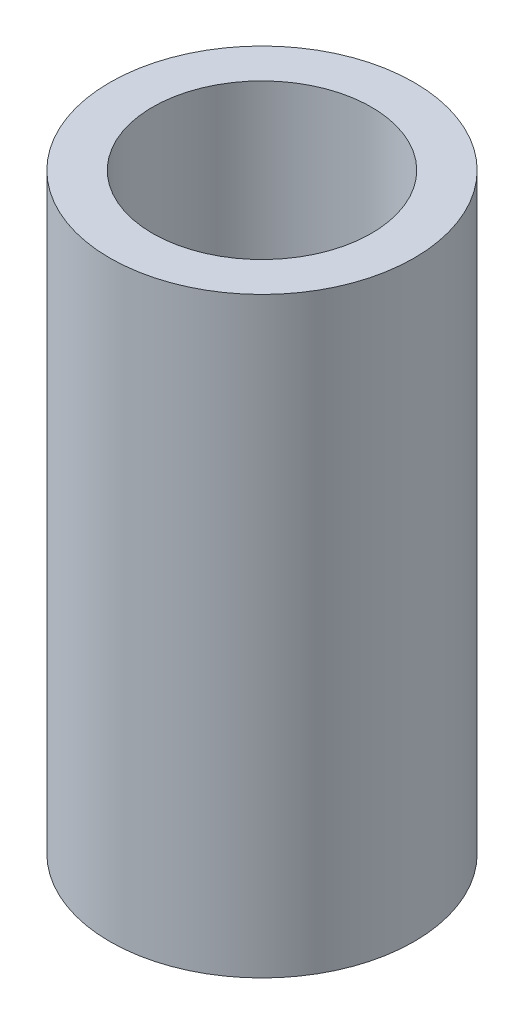
ISO-10303-21;
HEADER;
FILE_DESCRIPTION(('STEP AP214'),'2;1');
FILE_NAME('part.step','',(''),(''),'','','');
FILE_SCHEMA(('AUTOMOTIVE_DESIGN { 1 0 10303 214 1 1 1 1 }'));
ENDSEC;
DATA;
#1=APPLICATION_CONTEXT('core data for automotive mechanical design processes');
#2=APPLICATION_PROTOCOL_DEFINITION('international standard','automotive_design',2000,#1);
#3=PRODUCT_CONTEXT('',#1,'mechanical');
#4=PRODUCT('Part','Part','',(#3));
#5=PRODUCT_RELATED_PRODUCT_CATEGORY('part','',(#4));
#6=PRODUCT_DEFINITION_FORMATION('','',#4);
#7=PRODUCT_DEFINITION_CONTEXT('part definition',#1,'design');
#8=PRODUCT_DEFINITION('design','',#6,#7);
#9=PRODUCT_DEFINITION_SHAPE('','',#8);
#10=(LENGTH_UNIT() NAMED_UNIT(*) SI_UNIT(.MILLI.,.METRE.));
#11=(NAMED_UNIT(*) PLANE_ANGLE_UNIT() SI_UNIT($,.RADIAN.));
#12=(NAMED_UNIT(*) SI_UNIT($,.STERADIAN.) SOLID_ANGLE_UNIT());
#13=UNCERTAINTY_MEASURE_WITH_UNIT(LENGTH_MEASURE(1.E-05),#10,'distance_accuracy_value','');
#14=(GEOMETRIC_REPRESENTATION_CONTEXT(3) GLOBAL_UNCERTAINTY_ASSIGNED_CONTEXT((#13)) GLOBAL_UNIT_ASSIGNED_CONTEXT((#10,
#11,#12)) REPRESENTATION_CONTEXT('',''));
#15=CARTESIAN_POINT('',(0.,0.,0.));
#16=DIRECTION('',(0.,0.,1.));
#17=DIRECTION('',(1.,0.,0.));
#18=AXIS2_PLACEMENT_3D('',#15,#16,#17);
#19=CARTESIAN_POINT('',(0.,87.5405346438115,0.));
#20=DIRECTION('',(0.,-1.,0.));
#21=DIRECTION('',(0.,0.,-1.));
#22=AXIS2_PLACEMENT_3D('',#19,#20,#21);
#23=CYLINDRICAL_SURFACE('',#22,22.5);
#24=CARTESIAN_POINT('',(0.,87.5405346438115,0.));
#25=DIRECTION('',(0.,1.,0.));
#26=DIRECTION('',(0.,0.,1.));
#27=AXIS2_PLACEMENT_3D('',#24,#25,#26);
#28=CIRCLE('',#27,22.5);
#29=CARTESIAN_POINT('',(0.,87.5405346438115,22.5));
#30=VERTEX_POINT('',#29);
#31=EDGE_CURVE('E10',#30,#30,#28,.T.);
#32=ORIENTED_EDGE('',*,*,#31,.F.);
#33=EDGE_LOOP('',(#32));
#34=FACE_BOUND('',#33,.T.);
#35=CARTESIAN_POINT('',(0.,0.,0.));
#36=DIRECTION('',(0.,1.,0.));
#37=DIRECTION('',(0.,0.,1.));
#38=AXIS2_PLACEMENT_3D('',#35,#36,#37);
#39=CIRCLE('',#38,22.5);
#40=CARTESIAN_POINT('',(0.,0.,22.5));
#41=VERTEX_POINT('',#40);
#42=EDGE_CURVE('E37',#41,#41,#39,.T.);
#43=ORIENTED_EDGE('',*,*,#42,.T.);
#44=EDGE_LOOP('',(#43));
#45=FACE_BOUND('',#44,.T.);
#46=ADVANCED_FACE('F40',(#34,#45),#23,.T.);
#47=CARTESIAN_POINT('',(0.,87.5405346438115,0.));
#48=DIRECTION('',(0.,1.,0.));
#49=DIRECTION('',(0.,0.,1.));
#50=AXIS2_PLACEMENT_3D('',#47,#48,#49);
#51=PLANE('',#50);
#52=CARTESIAN_POINT('',(0.,87.5405346438115,0.));
#53=DIRECTION('',(0.,1.,0.));
#54=DIRECTION('',(0.,0.,1.));
#55=AXIS2_PLACEMENT_3D('',#52,#53,#54);
#56=CIRCLE('',#55,16.1838825567381);
#57=CARTESIAN_POINT('',(0.,87.5405346438115,16.1838825567381));
#58=VERTEX_POINT('',#57);
#59=EDGE_CURVE('E50',#58,#58,#56,.T.);
#60=ORIENTED_EDGE('',*,*,#59,.F.);
#61=EDGE_LOOP('',(#60));
#62=FACE_BOUND('',#61,.T.);
#63=ORIENTED_EDGE('',*,*,#31,.T.);
#64=EDGE_LOOP('',(#63));
#65=FACE_BOUND('',#64,.T.);
#66=ADVANCED_FACE('F59',(#62,#65),#51,.T.);
#67=CARTESIAN_POINT('',(0.,0.,0.));
#68=DIRECTION('',(0.,1.,0.));
#69=DIRECTION('',(0.,0.,1.));
#70=AXIS2_PLACEMENT_3D('',#67,#68,#69);
#71=PLANE('',#70);
#72=CARTESIAN_POINT('',(0.,0.,0.));
#73=DIRECTION('',(0.,1.,0.));
#74=DIRECTION('',(0.,0.,1.));
#75=AXIS2_PLACEMENT_3D('',#72,#73,#74);
#76=CIRCLE('',#75,16.1838825567381);
#77=CARTESIAN_POINT('',(0.,0.,16.1838825567381));
#78=VERTEX_POINT('',#77);
#79=EDGE_CURVE('E47',#78,#78,#76,.T.);
#80=ORIENTED_EDGE('',*,*,#79,.T.);
#81=EDGE_LOOP('',(#80));
#82=FACE_BOUND('',#81,.T.);
#83=ORIENTED_EDGE('',*,*,#42,.F.);
#84=EDGE_LOOP('',(#83));
#85=FACE_BOUND('',#84,.T.);
#86=ADVANCED_FACE('F58',(#82,#85),#71,.F.);
#87=CARTESIAN_POINT('',(0.,87.5405346438115,0.));
#88=DIRECTION('',(0.,-1.,0.));
#89=DIRECTION('',(0.,0.,-1.));
#90=AXIS2_PLACEMENT_3D('',#87,#88,#89);
#91=CYLINDRICAL_SURFACE('',#90,16.1838825567381);
#92=ORIENTED_EDGE('',*,*,#59,.T.);
#93=EDGE_LOOP('',(#92));
#94=FACE_BOUND('',#93,.T.);
#95=ORIENTED_EDGE('',*,*,#79,.F.);
#96=EDGE_LOOP('',(#95));
#97=FACE_BOUND('',#96,.T.);
#98=ADVANCED_FACE('F54',(#94,#97),#91,.F.);
#99=CLOSED_SHELL('',(#46,#66,#86,#98));
#100=MANIFOLD_SOLID_BREP('B2',#99);
#101=ADVANCED_BREP_SHAPE_REPRESENTATION('',(#18,#100),#14);
#102=SHAPE_DEFINITION_REPRESENTATION(#9,#101);
ENDSEC;
END-ISO-10303-21;
